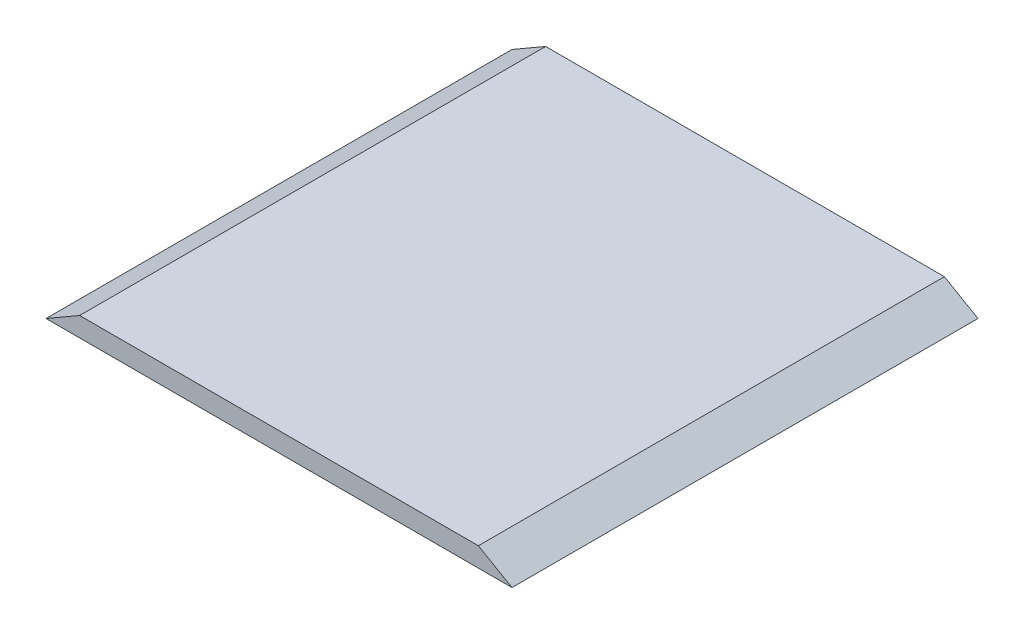
ISO-10303-21;
HEADER;
FILE_DESCRIPTION(('STEP AP214'),'2;1');
FILE_NAME('part.step','',(''),(''),'','','');
FILE_SCHEMA(('AUTOMOTIVE_DESIGN { 1 0 10303 214 1 1 1 1 }'));
ENDSEC;
DATA;
#1=APPLICATION_CONTEXT('core data for automotive mechanical design processes');
#2=APPLICATION_PROTOCOL_DEFINITION('international standard','automotive_design',2000,#1);
#3=PRODUCT_CONTEXT('',#1,'mechanical');
#4=PRODUCT('Part','Part','',(#3));
#5=PRODUCT_RELATED_PRODUCT_CATEGORY('part','',(#4));
#6=PRODUCT_DEFINITION_FORMATION('','',#4);
#7=PRODUCT_DEFINITION_CONTEXT('part definition',#1,'design');
#8=PRODUCT_DEFINITION('design','',#6,#7);
#9=PRODUCT_DEFINITION_SHAPE('','',#8);
#10=(LENGTH_UNIT() NAMED_UNIT(*) SI_UNIT(.MILLI.,.METRE.));
#11=(NAMED_UNIT(*) PLANE_ANGLE_UNIT() SI_UNIT($,.RADIAN.));
#12=(NAMED_UNIT(*) SI_UNIT($,.STERADIAN.) SOLID_ANGLE_UNIT());
#13=UNCERTAINTY_MEASURE_WITH_UNIT(LENGTH_MEASURE(1.E-05),#10,'distance_accuracy_value','');
#14=(GEOMETRIC_REPRESENTATION_CONTEXT(3) GLOBAL_UNCERTAINTY_ASSIGNED_CONTEXT((#13)) GLOBAL_UNIT_ASSIGNED_CONTEXT((#10,
#11,#12)) REPRESENTATION_CONTEXT('',''));
#15=CARTESIAN_POINT('',(0.,0.,0.));
#16=DIRECTION('',(0.,0.,1.));
#17=DIRECTION('',(1.,0.,0.));
#18=AXIS2_PLACEMENT_3D('',#15,#16,#17);
#19=CARTESIAN_POINT('',(0.,12.7,304.8));
#20=DIRECTION('',(0.,0.,-1.));
#21=DIRECTION('',(-1.,0.,0.));
#22=AXIS2_PLACEMENT_3D('',#19,#20,#21);
#23=PLANE('',#22);
#24=DIRECTION('',(1.,0.,0.));
#25=VECTOR('',#24,1.);
#26=CARTESIAN_POINT('',(0.,12.7,304.8));
#27=LINE('',#26,#25);
#28=CARTESIAN_POINT('',(21.9970452561249,12.7,304.8));
#29=VERTEX_POINT('',#28);
#30=CARTESIAN_POINT('',(282.802954743875,12.7,304.8));
#31=VERTEX_POINT('',#30);
#32=EDGE_CURVE('E40',#29,#31,#27,.T.);
#33=ORIENTED_EDGE('',*,*,#32,.F.);
#34=DIRECTION('',(0.86602540378444,0.499999999999998,0.));
#35=VECTOR('',#34,1.);
#36=CARTESIAN_POINT('',(0.,0.,304.8));
#37=LINE('',#36,#35);
#38=CARTESIAN_POINT('',(0.,0.,304.8));
#39=VERTEX_POINT('',#38);
#40=EDGE_CURVE('E75',#39,#29,#37,.T.);
#41=ORIENTED_EDGE('',*,*,#40,.F.);
#42=DIRECTION('',(1.,0.,0.));
#43=VECTOR('',#42,1.);
#44=CARTESIAN_POINT('',(0.,0.,304.8));
#45=LINE('',#44,#43);
#46=CARTESIAN_POINT('',(304.8,0.,304.8));
#47=VERTEX_POINT('',#46);
#48=EDGE_CURVE('E80',#39,#47,#45,.T.);
#49=ORIENTED_EDGE('',*,*,#48,.T.);
#50=DIRECTION('',(0.86602540378444,-0.499999999999998,0.));
#51=VECTOR('',#50,1.);
#52=CARTESIAN_POINT('',(304.8,0.,304.8));
#53=LINE('',#52,#51);
#54=EDGE_CURVE('E56',#31,#47,#53,.T.);
#55=ORIENTED_EDGE('',*,*,#54,.F.);
#56=EDGE_LOOP('',(#33,#41,#49,#55));
#57=FACE_BOUND('',#56,.T.);
#58=ADVANCED_FACE('F32',(#57),#23,.F.);
#59=CARTESIAN_POINT('',(0.,12.7,0.));
#60=DIRECTION('',(0.,0.,1.));
#61=DIRECTION('',(1.,0.,0.));
#62=AXIS2_PLACEMENT_3D('',#59,#60,#61);
#63=PLANE('',#62);
#64=DIRECTION('',(-1.,0.,0.));
#65=VECTOR('',#64,1.);
#66=CARTESIAN_POINT('',(0.,0.,0.));
#67=LINE('',#66,#65);
#68=CARTESIAN_POINT('',(304.8,0.,0.));
#69=VERTEX_POINT('',#68);
#70=CARTESIAN_POINT('',(0.,0.,0.));
#71=VERTEX_POINT('',#70);
#72=EDGE_CURVE('E35',#69,#71,#67,.T.);
#73=ORIENTED_EDGE('',*,*,#72,.T.);
#74=DIRECTION('',(0.86602540378444,0.499999999999998,0.));
#75=VECTOR('',#74,1.);
#76=CARTESIAN_POINT('',(0.,0.,0.));
#77=LINE('',#76,#75);
#78=CARTESIAN_POINT('',(21.9970452561249,12.7,0.));
#79=VERTEX_POINT('',#78);
#80=EDGE_CURVE('E48',#71,#79,#77,.T.);
#81=ORIENTED_EDGE('',*,*,#80,.T.);
#82=DIRECTION('',(-1.,0.,0.));
#83=VECTOR('',#82,1.);
#84=CARTESIAN_POINT('',(0.,12.7,0.));
#85=LINE('',#84,#83);
#86=CARTESIAN_POINT('',(282.802954743875,12.7,0.));
#87=VERTEX_POINT('',#86);
#88=EDGE_CURVE('E11',#87,#79,#85,.T.);
#89=ORIENTED_EDGE('',*,*,#88,.F.);
#90=DIRECTION('',(0.86602540378444,-0.499999999999998,0.));
#91=VECTOR('',#90,1.);
#92=CARTESIAN_POINT('',(304.8,0.,0.));
#93=LINE('',#92,#91);
#94=EDGE_CURVE('E95',#87,#69,#93,.T.);
#95=ORIENTED_EDGE('',*,*,#94,.T.);
#96=EDGE_LOOP('',(#73,#81,#89,#95));
#97=FACE_BOUND('',#96,.T.);
#98=ADVANCED_FACE('F102',(#97),#63,.F.);
#99=CARTESIAN_POINT('',(0.,12.7,0.));
#100=DIRECTION('',(0.,1.,0.));
#101=DIRECTION('',(0.,0.,1.));
#102=AXIS2_PLACEMENT_3D('',#99,#100,#101);
#103=PLANE('',#102);
#104=DIRECTION('',(0.,0.,1.));
#105=VECTOR('',#104,1.);
#106=CARTESIAN_POINT('',(21.9970452561249,12.7,0.));
#107=LINE('',#106,#105);
#108=EDGE_CURVE('E81',#79,#29,#107,.T.);
#109=ORIENTED_EDGE('',*,*,#108,.T.);
#110=ORIENTED_EDGE('',*,*,#32,.T.);
#111=DIRECTION('',(0.,0.,1.));
#112=VECTOR('',#111,1.);
#113=CARTESIAN_POINT('',(282.802954743875,12.7,0.));
#114=LINE('',#113,#112);
#115=EDGE_CURVE('E87',#87,#31,#114,.T.);
#116=ORIENTED_EDGE('',*,*,#115,.F.);
#117=ORIENTED_EDGE('',*,*,#88,.T.);
#118=EDGE_LOOP('',(#109,#110,#116,#117));
#119=FACE_BOUND('',#118,.T.);
#120=ADVANCED_FACE('F105',(#119),#103,.T.);
#121=CARTESIAN_POINT('',(0.,0.,0.));
#122=DIRECTION('',(0.,1.,0.));
#123=DIRECTION('',(0.,0.,1.));
#124=AXIS2_PLACEMENT_3D('',#121,#122,#123);
#125=PLANE('',#124);
#126=DIRECTION('',(0.,0.,1.));
#127=VECTOR('',#126,1.);
#128=CARTESIAN_POINT('',(0.,0.,0.));
#129=LINE('',#128,#127);
#130=EDGE_CURVE('E72',#71,#39,#129,.T.);
#131=ORIENTED_EDGE('',*,*,#130,.F.);
#132=ORIENTED_EDGE('',*,*,#72,.F.);
#133=DIRECTION('',(0.,0.,-1.));
#134=VECTOR('',#133,1.);
#135=CARTESIAN_POINT('',(304.8,0.,0.));
#136=LINE('',#135,#134);
#137=EDGE_CURVE('E90',#47,#69,#136,.T.);
#138=ORIENTED_EDGE('',*,*,#137,.F.);
#139=ORIENTED_EDGE('',*,*,#48,.F.);
#140=EDGE_LOOP('',(#131,#132,#138,#139));
#141=FACE_BOUND('',#140,.T.);
#142=ADVANCED_FACE('F89',(#141),#125,.F.);
#143=CARTESIAN_POINT('',(304.8,0.,0.));
#144=DIRECTION('',(-0.499999999999998,-0.86602540378444,0.));
#145=DIRECTION('',(0.86602540378444,-0.499999999999998,0.));
#146=AXIS2_PLACEMENT_3D('',#143,#144,#145);
#147=PLANE('',#146);
#148=ORIENTED_EDGE('',*,*,#54,.T.);
#149=ORIENTED_EDGE('',*,*,#137,.T.);
#150=ORIENTED_EDGE('',*,*,#94,.F.);
#151=ORIENTED_EDGE('',*,*,#115,.T.);
#152=EDGE_LOOP('',(#148,#149,#150,#151));
#153=FACE_BOUND('',#152,.T.);
#154=ADVANCED_FACE('F106',(#153),#147,.F.);
#155=CARTESIAN_POINT('',(0.,0.,0.));
#156=DIRECTION('',(0.499999999999998,-0.86602540378444,0.));
#157=DIRECTION('',(0.86602540378444,0.499999999999998,0.));
#158=AXIS2_PLACEMENT_3D('',#155,#156,#157);
#159=PLANE('',#158);
#160=ORIENTED_EDGE('',*,*,#40,.T.);
#161=ORIENTED_EDGE('',*,*,#108,.F.);
#162=ORIENTED_EDGE('',*,*,#80,.F.);
#163=ORIENTED_EDGE('',*,*,#130,.T.);
#164=EDGE_LOOP('',(#160,#161,#162,#163));
#165=FACE_BOUND('',#164,.T.);
#166=ADVANCED_FACE('F74',(#165),#159,.F.);
#167=CLOSED_SHELL('',(#58,#98,#120,#142,#154,#166));
#168=MANIFOLD_SOLID_BREP('B2',#167);
#169=ADVANCED_BREP_SHAPE_REPRESENTATION('',(#18,#168),#14);
#170=SHAPE_DEFINITION_REPRESENTATION(#9,#169);
ENDSEC;
END-ISO-10303-21;
